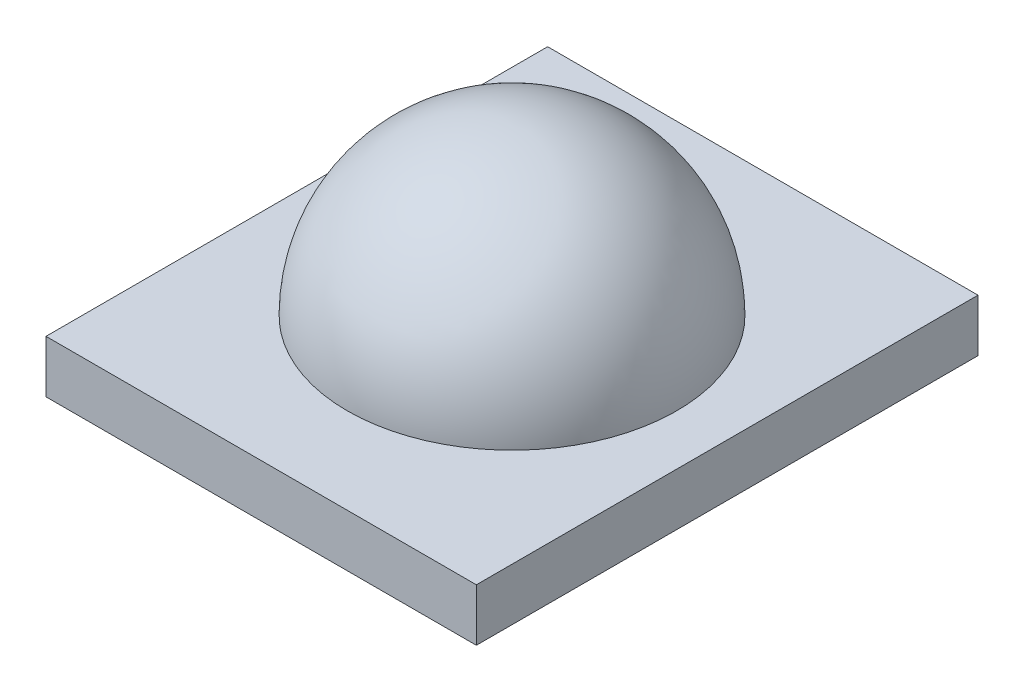
ISO-10303-21;
HEADER;
FILE_DESCRIPTION(('STEP AP214'),'2;1');
FILE_NAME('part.step','',(''),(''),'','','');
FILE_SCHEMA(('AUTOMOTIVE_DESIGN { 1 0 10303 214 1 1 1 1 }'));
ENDSEC;
DATA;
#1=APPLICATION_CONTEXT('core data for automotive mechanical design processes');
#2=APPLICATION_PROTOCOL_DEFINITION('international standard','automotive_design',2000,#1);
#3=PRODUCT_CONTEXT('',#1,'mechanical');
#4=PRODUCT('Part','Part','',(#3));
#5=PRODUCT_RELATED_PRODUCT_CATEGORY('part','',(#4));
#6=PRODUCT_DEFINITION_FORMATION('','',#4);
#7=PRODUCT_DEFINITION_CONTEXT('part definition',#1,'design');
#8=PRODUCT_DEFINITION('design','',#6,#7);
#9=PRODUCT_DEFINITION_SHAPE('','',#8);
#10=(LENGTH_UNIT() NAMED_UNIT(*) SI_UNIT(.MILLI.,.METRE.));
#11=(NAMED_UNIT(*) PLANE_ANGLE_UNIT() SI_UNIT($,.RADIAN.));
#12=(NAMED_UNIT(*) SI_UNIT($,.STERADIAN.) SOLID_ANGLE_UNIT());
#13=UNCERTAINTY_MEASURE_WITH_UNIT(LENGTH_MEASURE(1.E-05),#10,'distance_accuracy_value','');
#14=(GEOMETRIC_REPRESENTATION_CONTEXT(3) GLOBAL_UNCERTAINTY_ASSIGNED_CONTEXT((#13)) GLOBAL_UNIT_ASSIGNED_CONTEXT((#10,
#11,#12)) REPRESENTATION_CONTEXT('',''));
#15=CARTESIAN_POINT('',(0.,0.,0.));
#16=DIRECTION('',(0.,0.,1.));
#17=DIRECTION('',(1.,0.,0.));
#18=AXIS2_PLACEMENT_3D('',#15,#16,#17);
#19=CARTESIAN_POINT('',(-14.37,3.5,16.75));
#20=DIRECTION('',(1.,0.,0.));
#21=DIRECTION('',(0.,0.,-1.));
#22=AXIS2_PLACEMENT_3D('',#19,#20,#21);
#23=PLANE('',#22);
#24=DIRECTION('',(0.,0.,1.));
#25=VECTOR('',#24,1.);
#26=CARTESIAN_POINT('',(-14.37,0.,16.75));
#27=LINE('',#26,#25);
#28=CARTESIAN_POINT('',(-14.37,0.,-16.75));
#29=VERTEX_POINT('',#28);
#30=CARTESIAN_POINT('',(-14.37,0.,16.75));
#31=VERTEX_POINT('',#30);
#32=EDGE_CURVE('E99',#29,#31,#27,.T.);
#33=ORIENTED_EDGE('',*,*,#32,.T.);
#34=DIRECTION('',(0.,-1.,0.));
#35=VECTOR('',#34,1.);
#36=CARTESIAN_POINT('',(-14.37,3.5,16.75));
#37=LINE('',#36,#35);
#38=CARTESIAN_POINT('',(-14.37,3.5,16.75));
#39=VERTEX_POINT('',#38);
#40=EDGE_CURVE('E41',#39,#31,#37,.T.);
#41=ORIENTED_EDGE('',*,*,#40,.F.);
#42=DIRECTION('',(0.,0.,1.));
#43=VECTOR('',#42,1.);
#44=CARTESIAN_POINT('',(-14.37,3.5,16.75));
#45=LINE('',#44,#43);
#46=CARTESIAN_POINT('',(-14.37,3.5,-16.75));
#47=VERTEX_POINT('',#46);
#48=EDGE_CURVE('E85',#47,#39,#45,.T.);
#49=ORIENTED_EDGE('',*,*,#48,.F.);
#50=DIRECTION('',(0.,-1.,0.));
#51=VECTOR('',#50,1.);
#52=CARTESIAN_POINT('',(-14.37,3.5,-16.75));
#53=LINE('',#52,#51);
#54=EDGE_CURVE('E95',#47,#29,#53,.T.);
#55=ORIENTED_EDGE('',*,*,#54,.T.);
#56=EDGE_LOOP('',(#33,#41,#49,#55));
#57=FACE_BOUND('',#56,.T.);
#58=ADVANCED_FACE('F33',(#57),#23,.F.);
#59=CARTESIAN_POINT('',(14.37,3.5,16.75));
#60=DIRECTION('',(0.,0.,-1.));
#61=DIRECTION('',(-1.,0.,0.));
#62=AXIS2_PLACEMENT_3D('',#59,#60,#61);
#63=PLANE('',#62);
#64=DIRECTION('',(1.,0.,0.));
#65=VECTOR('',#64,1.);
#66=CARTESIAN_POINT('',(14.37,0.,16.75));
#67=LINE('',#66,#65);
#68=CARTESIAN_POINT('',(14.37,0.,16.75));
#69=VERTEX_POINT('',#68);
#70=EDGE_CURVE('E90',#31,#69,#67,.T.);
#71=ORIENTED_EDGE('',*,*,#70,.T.);
#72=DIRECTION('',(0.,-1.,0.));
#73=VECTOR('',#72,1.);
#74=CARTESIAN_POINT('',(14.37,3.5,16.75));
#75=LINE('',#74,#73);
#76=CARTESIAN_POINT('',(14.37,3.5,16.75));
#77=VERTEX_POINT('',#76);
#78=EDGE_CURVE('E88',#77,#69,#75,.T.);
#79=ORIENTED_EDGE('',*,*,#78,.F.);
#80=DIRECTION('',(1.,0.,0.));
#81=VECTOR('',#80,1.);
#82=CARTESIAN_POINT('',(14.37,3.5,16.75));
#83=LINE('',#82,#81);
#84=EDGE_CURVE('E80',#39,#77,#83,.T.);
#85=ORIENTED_EDGE('',*,*,#84,.F.);
#86=ORIENTED_EDGE('',*,*,#40,.T.);
#87=EDGE_LOOP('',(#71,#79,#85,#86));
#88=FACE_BOUND('',#87,.T.);
#89=ADVANCED_FACE('F89',(#88),#63,.F.);
#90=CARTESIAN_POINT('',(14.37,3.5,16.75));
#91=DIRECTION('',(-1.,0.,0.));
#92=DIRECTION('',(0.,0.,1.));
#93=AXIS2_PLACEMENT_3D('',#90,#91,#92);
#94=PLANE('',#93);
#95=DIRECTION('',(0.,0.,-1.));
#96=VECTOR('',#95,1.);
#97=CARTESIAN_POINT('',(14.37,0.,16.75));
#98=LINE('',#97,#96);
#99=CARTESIAN_POINT('',(14.37,0.,-16.75));
#100=VERTEX_POINT('',#99);
#101=EDGE_CURVE('E66',#69,#100,#98,.T.);
#102=ORIENTED_EDGE('',*,*,#101,.T.);
#103=DIRECTION('',(0.,-1.,0.));
#104=VECTOR('',#103,1.);
#105=CARTESIAN_POINT('',(14.37,3.5,-16.75));
#106=LINE('',#105,#104);
#107=CARTESIAN_POINT('',(14.37,3.5,-16.75));
#108=VERTEX_POINT('',#107);
#109=EDGE_CURVE('E91',#108,#100,#106,.T.);
#110=ORIENTED_EDGE('',*,*,#109,.F.);
#111=DIRECTION('',(0.,0.,-1.));
#112=VECTOR('',#111,1.);
#113=CARTESIAN_POINT('',(14.37,3.5,16.75));
#114=LINE('',#113,#112);
#115=EDGE_CURVE('E83',#77,#108,#114,.T.);
#116=ORIENTED_EDGE('',*,*,#115,.F.);
#117=ORIENTED_EDGE('',*,*,#78,.T.);
#118=EDGE_LOOP('',(#102,#110,#116,#117));
#119=FACE_BOUND('',#118,.T.);
#120=ADVANCED_FACE('F93',(#119),#94,.F.);
#121=CARTESIAN_POINT('',(14.37,3.5,-16.75));
#122=DIRECTION('',(0.,0.,1.));
#123=DIRECTION('',(1.,0.,0.));
#124=AXIS2_PLACEMENT_3D('',#121,#122,#123);
#125=PLANE('',#124);
#126=DIRECTION('',(-1.,0.,0.));
#127=VECTOR('',#126,1.);
#128=CARTESIAN_POINT('',(14.37,0.,-16.75));
#129=LINE('',#128,#127);
#130=EDGE_CURVE('E72',#100,#29,#129,.T.);
#131=ORIENTED_EDGE('',*,*,#130,.T.);
#132=ORIENTED_EDGE('',*,*,#54,.F.);
#133=DIRECTION('',(-1.,0.,0.));
#134=VECTOR('',#133,1.);
#135=CARTESIAN_POINT('',(14.37,3.5,-16.75));
#136=LINE('',#135,#134);
#137=EDGE_CURVE('E49',#108,#47,#136,.T.);
#138=ORIENTED_EDGE('',*,*,#137,.F.);
#139=ORIENTED_EDGE('',*,*,#109,.T.);
#140=EDGE_LOOP('',(#131,#132,#138,#139));
#141=FACE_BOUND('',#140,.T.);
#142=ADVANCED_FACE('F119',(#141),#125,.F.);
#143=CARTESIAN_POINT('',(0.,3.5,0.));
#144=DIRECTION('',(0.,1.,0.));
#145=DIRECTION('',(0.,0.,1.));
#146=AXIS2_PLACEMENT_3D('',#143,#144,#145);
#147=PLANE('',#146);
#148=CARTESIAN_POINT('',(0.,3.5,0.));
#149=DIRECTION('',(0.,1.,0.));
#150=DIRECTION('',(0.,0.,1.));
#151=AXIS2_PLACEMENT_3D('',#148,#149,#150);
#152=CIRCLE('',#151,11.0004545360635);
#153=CARTESIAN_POINT('',(0.,3.5,11.0004545360635));
#154=VERTEX_POINT('',#153);
#155=EDGE_CURVE('E11',#154,#154,#152,.T.);
#156=ORIENTED_EDGE('',*,*,#155,.F.);
#157=EDGE_LOOP('',(#156));
#158=FACE_BOUND('',#157,.T.);
#159=ORIENTED_EDGE('',*,*,#48,.T.);
#160=ORIENTED_EDGE('',*,*,#84,.T.);
#161=ORIENTED_EDGE('',*,*,#115,.T.);
#162=ORIENTED_EDGE('',*,*,#137,.T.);
#163=EDGE_LOOP('',(#159,#160,#161,#162));
#164=FACE_BOUND('',#163,.T.);
#165=ADVANCED_FACE('F81',(#158,#164),#147,.T.);
#166=CARTESIAN_POINT('',(0.,0.,0.));
#167=DIRECTION('',(0.,1.,0.));
#168=DIRECTION('',(0.,0.,1.));
#169=AXIS2_PLACEMENT_3D('',#166,#167,#168);
#170=PLANE('',#169);
#171=ORIENTED_EDGE('',*,*,#32,.F.);
#172=ORIENTED_EDGE('',*,*,#130,.F.);
#173=ORIENTED_EDGE('',*,*,#101,.F.);
#174=ORIENTED_EDGE('',*,*,#70,.F.);
#175=EDGE_LOOP('',(#171,#172,#173,#174));
#176=FACE_BOUND('',#175,.T.);
#177=ADVANCED_FACE('F109',(#176),#170,.F.);
#178=CARTESIAN_POINT('',(0.,3.5,0.));
#179=DIRECTION('',(0.,1.,0.));
#180=DIRECTION('',(0.,0.,1.));
#181=AXIS2_PLACEMENT_3D('',#178,#179,#180);
#182=SPHERICAL_SURFACE('',#181,11.0004545360635);
#183=ORIENTED_EDGE('',*,*,#155,.T.);
#184=EDGE_LOOP('',(#183));
#185=FACE_BOUND('',#184,.T.);
#186=ADVANCED_FACE('F111',(#185),#182,.T.);
#187=CLOSED_SHELL('',(#58,#89,#120,#142,#165,#177,#186));
#188=MANIFOLD_SOLID_BREP('B2',#187);
#189=ADVANCED_BREP_SHAPE_REPRESENTATION('',(#18,#188),#14);
#190=SHAPE_DEFINITION_REPRESENTATION(#9,#189);
ENDSEC;
END-ISO-10303-21;
